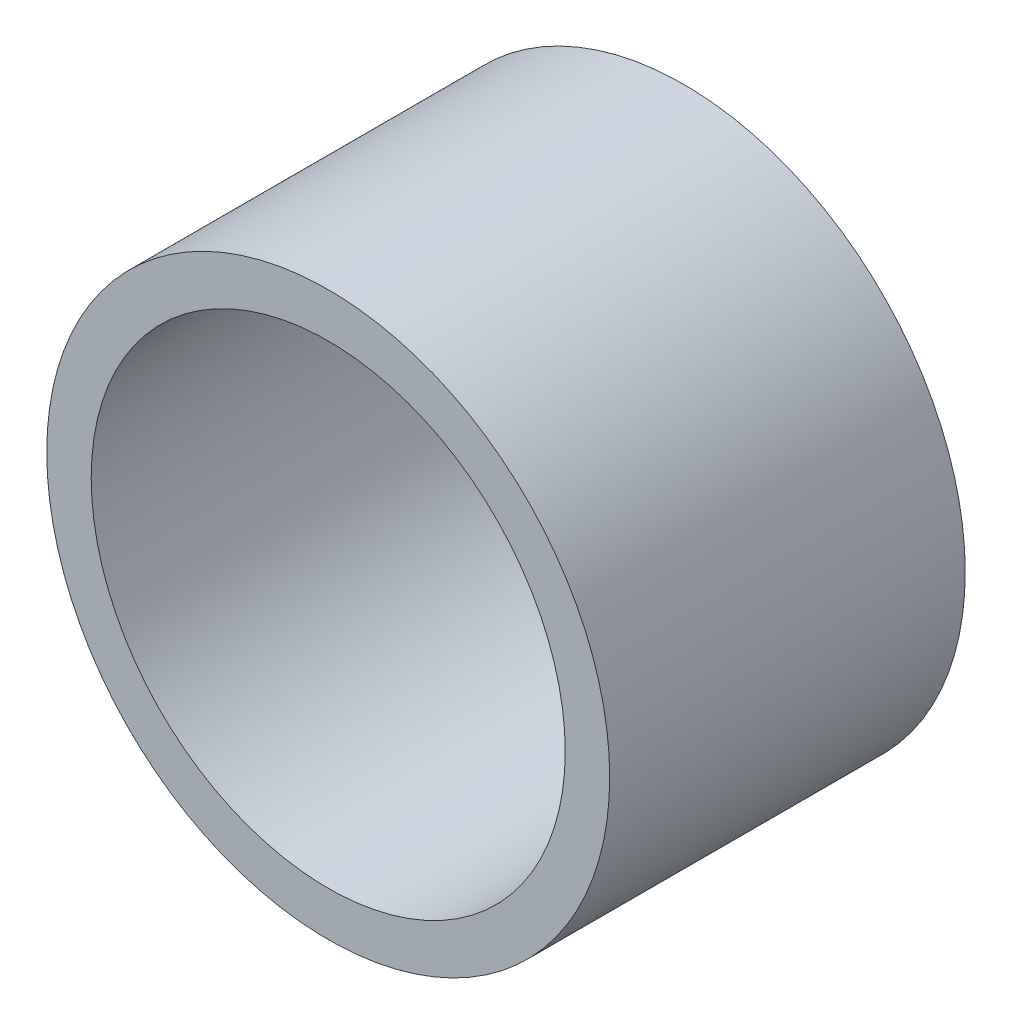
ISO-10303-21;
HEADER;
FILE_DESCRIPTION(('STEP AP214'),'2;1');
FILE_NAME('part.step','',(''),(''),'','','');
FILE_SCHEMA(('AUTOMOTIVE_DESIGN { 1 0 10303 214 1 1 1 1 }'));
ENDSEC;
DATA;
#1=APPLICATION_CONTEXT('core data for automotive mechanical design processes');
#2=APPLICATION_PROTOCOL_DEFINITION('international standard','automotive_design',2000,#1);
#3=PRODUCT_CONTEXT('',#1,'mechanical');
#4=PRODUCT('Part','Part','',(#3));
#5=PRODUCT_RELATED_PRODUCT_CATEGORY('part','',(#4));
#6=PRODUCT_DEFINITION_FORMATION('','',#4);
#7=PRODUCT_DEFINITION_CONTEXT('part definition',#1,'design');
#8=PRODUCT_DEFINITION('design','',#6,#7);
#9=PRODUCT_DEFINITION_SHAPE('','',#8);
#10=(LENGTH_UNIT() NAMED_UNIT(*) SI_UNIT(.MILLI.,.METRE.));
#11=(NAMED_UNIT(*) PLANE_ANGLE_UNIT() SI_UNIT($,.RADIAN.));
#12=(NAMED_UNIT(*) SI_UNIT($,.STERADIAN.) SOLID_ANGLE_UNIT());
#13=UNCERTAINTY_MEASURE_WITH_UNIT(LENGTH_MEASURE(1.E-05),#10,'distance_accuracy_value','');
#14=(GEOMETRIC_REPRESENTATION_CONTEXT(3) GLOBAL_UNCERTAINTY_ASSIGNED_CONTEXT((#13)) GLOBAL_UNIT_ASSIGNED_CONTEXT((#10,
#11,#12)) REPRESENTATION_CONTEXT('',''));
#15=CARTESIAN_POINT('',(0.,0.,0.));
#16=DIRECTION('',(0.,0.,1.));
#17=DIRECTION('',(1.,0.,0.));
#18=AXIS2_PLACEMENT_3D('',#15,#16,#17);
#19=CARTESIAN_POINT('',(0.,0.,12.));
#20=DIRECTION('',(0.,0.,1.));
#21=DIRECTION('',(1.,0.,0.));
#22=AXIS2_PLACEMENT_3D('',#19,#20,#21);
#23=PLANE('',#22);
#24=CARTESIAN_POINT('',(0.,0.,12.));
#25=DIRECTION('',(0.,0.,1.));
#26=DIRECTION('',(1.,0.,0.));
#27=AXIS2_PLACEMENT_3D('',#24,#25,#26);
#28=CIRCLE('',#27,9.5);
#29=CARTESIAN_POINT('',(9.5,0.,12.));
#30=VERTEX_POINT('',#29);
#31=EDGE_CURVE('E10',#30,#30,#28,.T.);
#32=ORIENTED_EDGE('',*,*,#31,.T.);
#33=EDGE_LOOP('',(#32));
#34=FACE_BOUND('',#33,.T.);
#35=CARTESIAN_POINT('',(0.,0.,12.));
#36=DIRECTION('',(0.,0.,1.));
#37=DIRECTION('',(1.,0.,0.));
#38=AXIS2_PLACEMENT_3D('',#35,#36,#37);
#39=CIRCLE('',#38,8.);
#40=CARTESIAN_POINT('',(8.,0.,12.));
#41=VERTEX_POINT('',#40);
#42=EDGE_CURVE('E42',#41,#41,#39,.T.);
#43=ORIENTED_EDGE('',*,*,#42,.F.);
#44=EDGE_LOOP('',(#43));
#45=FACE_BOUND('',#44,.T.);
#46=ADVANCED_FACE('F31',(#34,#45),#23,.T.);
#47=CARTESIAN_POINT('',(0.,0.,0.));
#48=DIRECTION('',(0.,0.,1.));
#49=DIRECTION('',(1.,0.,0.));
#50=AXIS2_PLACEMENT_3D('',#47,#48,#49);
#51=PLANE('',#50);
#52=CARTESIAN_POINT('',(0.,0.,0.));
#53=DIRECTION('',(0.,0.,1.));
#54=DIRECTION('',(1.,0.,0.));
#55=AXIS2_PLACEMENT_3D('',#52,#53,#54);
#56=CIRCLE('',#55,9.5);
#57=CARTESIAN_POINT('',(9.5,0.,0.));
#58=VERTEX_POINT('',#57);
#59=EDGE_CURVE('E35',#58,#58,#56,.T.);
#60=ORIENTED_EDGE('',*,*,#59,.F.);
#61=EDGE_LOOP('',(#60));
#62=FACE_BOUND('',#61,.T.);
#63=CARTESIAN_POINT('',(0.,0.,0.));
#64=DIRECTION('',(0.,0.,1.));
#65=DIRECTION('',(1.,0.,0.));
#66=AXIS2_PLACEMENT_3D('',#63,#64,#65);
#67=CIRCLE('',#66,8.);
#68=CARTESIAN_POINT('',(8.,0.,0.));
#69=VERTEX_POINT('',#68);
#70=EDGE_CURVE('E44',#69,#69,#67,.T.);
#71=ORIENTED_EDGE('',*,*,#70,.T.);
#72=EDGE_LOOP('',(#71));
#73=FACE_BOUND('',#72,.T.);
#74=ADVANCED_FACE('F54',(#62,#73),#51,.F.);
#75=CARTESIAN_POINT('',(0.,0.,12.));
#76=DIRECTION('',(0.,0.,-1.));
#77=DIRECTION('',(-1.,0.,0.));
#78=AXIS2_PLACEMENT_3D('',#75,#76,#77);
#79=CYLINDRICAL_SURFACE('',#78,9.5);
#80=ORIENTED_EDGE('',*,*,#31,.F.);
#81=EDGE_LOOP('',(#80));
#82=FACE_BOUND('',#81,.T.);
#83=ORIENTED_EDGE('',*,*,#59,.T.);
#84=EDGE_LOOP('',(#83));
#85=FACE_BOUND('',#84,.T.);
#86=ADVANCED_FACE('F33',(#82,#85),#79,.T.);
#87=CARTESIAN_POINT('',(0.,0.,12.));
#88=DIRECTION('',(0.,0.,-1.));
#89=DIRECTION('',(-1.,0.,0.));
#90=AXIS2_PLACEMENT_3D('',#87,#88,#89);
#91=CYLINDRICAL_SURFACE('',#90,8.);
#92=ORIENTED_EDGE('',*,*,#42,.T.);
#93=EDGE_LOOP('',(#92));
#94=FACE_BOUND('',#93,.T.);
#95=ORIENTED_EDGE('',*,*,#70,.F.);
#96=EDGE_LOOP('',(#95));
#97=FACE_BOUND('',#96,.T.);
#98=ADVANCED_FACE('F50',(#94,#97),#91,.F.);
#99=CLOSED_SHELL('',(#46,#74,#86,#98));
#100=MANIFOLD_SOLID_BREP('B2',#99);
#101=ADVANCED_BREP_SHAPE_REPRESENTATION('',(#18,#100),#14);
#102=SHAPE_DEFINITION_REPRESENTATION(#9,#101);
ENDSEC;
END-ISO-10303-21;
